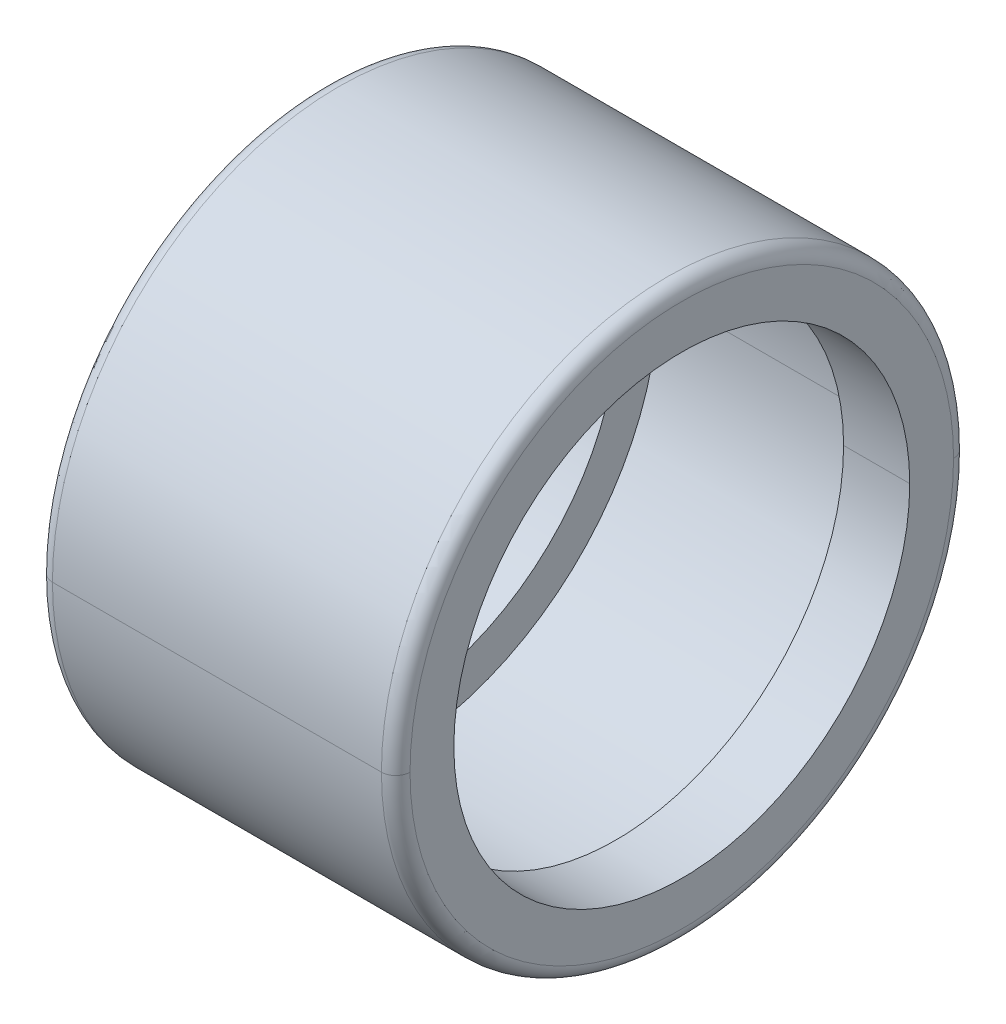
ISO-10303-21;
HEADER;
FILE_DESCRIPTION(('STEP AP214'),'2;1');
FILE_NAME('part.step','',(''),(''),'','','');
FILE_SCHEMA(('AUTOMOTIVE_DESIGN { 1 0 10303 214 1 1 1 1 }'));
ENDSEC;
DATA;
#1=APPLICATION_CONTEXT('core data for automotive mechanical design processes');
#2=APPLICATION_PROTOCOL_DEFINITION('international standard','automotive_design',2000,#1);
#3=PRODUCT_CONTEXT('',#1,'mechanical');
#4=PRODUCT('Part','Part','',(#3));
#5=PRODUCT_RELATED_PRODUCT_CATEGORY('part','',(#4));
#6=PRODUCT_DEFINITION_FORMATION('','',#4);
#7=PRODUCT_DEFINITION_CONTEXT('part definition',#1,'design');
#8=PRODUCT_DEFINITION('design','',#6,#7);
#9=PRODUCT_DEFINITION_SHAPE('','',#8);
#10=(LENGTH_UNIT() NAMED_UNIT(*) SI_UNIT(.MILLI.,.METRE.));
#11=(NAMED_UNIT(*) PLANE_ANGLE_UNIT() SI_UNIT($,.RADIAN.));
#12=(NAMED_UNIT(*) SI_UNIT($,.STERADIAN.) SOLID_ANGLE_UNIT());
#13=UNCERTAINTY_MEASURE_WITH_UNIT(LENGTH_MEASURE(1.E-05),#10,'distance_accuracy_value','');
#14=(GEOMETRIC_REPRESENTATION_CONTEXT(3) GLOBAL_UNCERTAINTY_ASSIGNED_CONTEXT((#13)) GLOBAL_UNIT_ASSIGNED_CONTEXT((#10,
#11,#12)) REPRESENTATION_CONTEXT('',''));
#15=CARTESIAN_POINT('',(0.,0.,0.));
#16=DIRECTION('',(0.,0.,1.));
#17=DIRECTION('',(1.,0.,0.));
#18=AXIS2_PLACEMENT_3D('',#15,#16,#17);
#19=CARTESIAN_POINT('',(0.400000000000029,0.,0.));
#20=DIRECTION('',(1.,0.,0.));
#21=DIRECTION('',(0.,1.,0.));
#22=AXIS2_PLACEMENT_3D('',#19,#20,#21);
#23=TOROIDAL_SURFACE('',#22,7.6,0.4);
#24=CARTESIAN_POINT('',(0.,0.,0.));
#25=DIRECTION('',(1.,0.,0.));
#26=DIRECTION('',(0.,0.,-1.));
#27=AXIS2_PLACEMENT_3D('',#24,#25,#26);
#28=CIRCLE('',#27,7.6);
#29=CARTESIAN_POINT('',(0.,0.,7.6));
#30=VERTEX_POINT('',#29);
#31=CARTESIAN_POINT('',(0.,0.,-7.6));
#32=VERTEX_POINT('',#31);
#33=EDGE_CURVE('E11',#30,#32,#28,.T.);
#34=ORIENTED_EDGE('',*,*,#33,.T.);
#35=CARTESIAN_POINT('',(0.,0.,-7.6));
#36=CARTESIAN_POINT('',(-1.38835481056677E-07,0.,-7.60654499130435));
#37=CARTESIAN_POINT('',(0.000160633149967865,0.,-7.61308997079517));
#38=CARTESIAN_POINT('',(0.000803001885952105,0.,-7.62616416866676));
#39=CARTESIAN_POINT('',(0.0012845986364874,0.,-7.63269338704754));
#40=CARTESIAN_POINT('',(0.00256762002581285,0.,-7.6457203252161));
#41=CARTESIAN_POINT('',(0.00336904466460301,0.,-7.65221804500389));
#42=CARTESIAN_POINT('',(0.00528974736362985,0.,-7.66516633456039));
#43=CARTESIAN_POINT('',(0.00640902542386653,0.,-7.67161690432911));
#44=CARTESIAN_POINT('',(0.00896275025360659,0.,-7.68445535328379));
#45=CARTESIAN_POINT('',(0.01039719702311,0.,-7.69084323246976));
#46=CARTESIAN_POINT('',(0.0135778004213121,0.,-7.70354091145285));
#47=CARTESIAN_POINT('',(0.0153239570500109,0.,-7.70985071124997));
#48=CARTESIAN_POINT('',(0.0191237743642793,0.,-7.7223770305536));
#49=CARTESIAN_POINT('',(0.0211774350498489,0.,-7.72859355006012));
#50=CARTESIAN_POINT('',(0.0255873128037914,0.,-7.74091833265365));
#51=CARTESIAN_POINT('',(0.0279435298721642,0.,-7.74702659574066));
#52=CARTESIAN_POINT('',(0.0329528441188634,0.,-7.75912015015141));
#53=CARTESIAN_POINT('',(0.0356059412971897,0.,-7.76510544147514));
#54=CARTESIAN_POINT('',(0.0412026242041124,0.,-7.77693863326908));
#55=CARTESIAN_POINT('',(0.0441462099327088,0.,-7.78278653373929));
#56=CARTESIAN_POINT('',(0.0503167785886638,0.,-7.79433085572151));
#57=CARTESIAN_POINT('',(0.0535437615160222,0.,-7.80002727723352));
#58=CARTESIAN_POINT('',(0.0602733504838164,0.,-7.81125491812105));
#59=CARTESIAN_POINT('',(0.0637759565242521,0.,-7.81678613749656));
#60=CARTESIAN_POINT('',(0.0710483536337682,0.,-7.82767004891912));
#61=CARTESIAN_POINT('',(0.0748181447028487,0.,-7.83302274096616));
#62=CARTESIAN_POINT('',(0.0826158301126913,0.,-7.84353670262779));
#63=CARTESIAN_POINT('',(0.0866437244534535,0.,-7.84869797224238));
#64=CARTESIAN_POINT('',(0.0949479128564129,0.,-7.85881665508853));
#65=CARTESIAN_POINT('',(0.0992242069186102,0.,-7.8637740683201));
#66=CARTESIAN_POINT('',(0.108014892797479,0.,-7.87347309555751));
#67=CARTESIAN_POINT('',(0.11252928461415,0.,-7.87821470956336));
#68=CARTESIAN_POINT('',(0.121785290436668,0.,-7.88747071538588));
#69=CARTESIAN_POINT('',(0.126526904442514,0.,-7.89198510720255));
#70=CARTESIAN_POINT('',(0.136225931679926,0.,-7.90077579308142));
#71=CARTESIAN_POINT('',(0.141183344911492,0.,-7.90505208714361));
#72=CARTESIAN_POINT('',(0.151302027757648,0.,-7.91335627554657));
#73=CARTESIAN_POINT('',(0.156463297372239,0.,-7.91738416988733));
#74=CARTESIAN_POINT('',(0.16697725903387,0.,-7.92518185529718));
#75=CARTESIAN_POINT('',(0.172329951080911,0.,-7.92895164636626));
#76=CARTESIAN_POINT('',(0.183213862503463,0.,-7.93622404347578));
#77=CARTESIAN_POINT('',(0.188745081878975,0.,-7.93972664951621));
#78=CARTESIAN_POINT('',(0.199972722766502,0.,-7.94645623848401));
#79=CARTESIAN_POINT('',(0.205669144278518,0.,-7.94968322141136));
#80=CARTESIAN_POINT('',(0.217213466260739,0.,-7.95585379006732));
#81=CARTESIAN_POINT('',(0.223061366730945,0.,-7.95879737579591));
#82=CARTESIAN_POINT('',(0.234894558524885,0.,-7.96439405870284));
#83=CARTESIAN_POINT('',(0.240879849848619,0.,-7.96704715588116));
#84=CARTESIAN_POINT('',(0.252973404259364,0.,-7.97205647012786));
#85=CARTESIAN_POINT('',(0.259081667346374,0.,-7.97441268719624));
#86=CARTESIAN_POINT('',(0.271406449939904,0.,-7.97882256495018));
#87=CARTESIAN_POINT('',(0.277622969446424,0.,-7.98087622563575));
#88=CARTESIAN_POINT('',(0.290149288750061,0.,-7.98467604295002));
#89=CARTESIAN_POINT('',(0.296459088547178,0.,-7.98642219957872));
#90=CARTESIAN_POINT('',(0.309156767530265,0.,-7.98960280297692));
#91=CARTESIAN_POINT('',(0.315544646716234,0.,-7.99103724974642));
#92=CARTESIAN_POINT('',(0.328383095670918,0.,-7.99359097457616));
#93=CARTESIAN_POINT('',(0.334833665439632,0.,-7.9947102526364));
#94=CARTESIAN_POINT('',(0.347781954996133,0.,-7.99663095533542));
#95=CARTESIAN_POINT('',(0.35427967478392,0.,-7.99743237997422));
#96=CARTESIAN_POINT('',(0.367306612952486,0.,-7.99871540136354));
#97=CARTESIAN_POINT('',(0.373835831333264,0.,-7.99919699811408));
#98=CARTESIAN_POINT('',(0.386910029204856,0.,-7.99983936685006));
#99=CARTESIAN_POINT('',(0.393455008695671,0.,-8.00000013883551));
#100=CARTESIAN_POINT('',(0.400000000000027,0.,-8.));
#101=B_SPLINE_CURVE_WITH_KNOTS('',3,(#35,#36,#37,#38,#39,#40,#41,#42,#43,#44,#45,#46,#47,#48,
#49,#50,#51,#52,#53,#54,#55,#56,#57,#58,#59,#60,#61,#62,#63,#64,#65,#66,#67,#68,#69,#70,#71,#72,
#73,#74,#75,#76,#77,#78,#79,#80,#81,#82,#83,#84,#85,#86,#87,#88,#89,#90,#91,#92,#93,#94,#95,#96,
#97,#98,#99,#100),.UNSPECIFIED.,.F.,.F.,(4,2,2,2,2,2,2,2,2,2,2,2,2,2,2,2,2,2,2,2,2,2,2,2,2,2,2,
2,2,2,2,2,4),(0.,0.0196329828183305,0.0392659656366597,0.0588989484549896,0.0785319312733197,
0.0981649140916497,0.117797896909979,0.137430879728309,0.157063862546639,0.176696845364969,
0.196329828183298,0.215962811001629,0.235595793819958,0.255228776638289,0.274861759456618,
0.294494742274948,0.314127725093278,0.333760707911607,0.353393690729937,0.373026673548267,
0.392659656366596,0.412292639184927,0.431925622003257,0.451558604821586,0.471191587639916,
0.490824570458246,0.510457553276576,0.530090536094905,0.549723518913235,0.569356501731565,
0.588989484549895,0.608622467368225,0.628255450186554),.UNSPECIFIED.);
#102=CARTESIAN_POINT('',(0.399999999999998,0.,-8.));
#103=VERTEX_POINT('',#102);
#104=EDGE_CURVE('E26',#32,#103,#101,.T.);
#105=ORIENTED_EDGE('',*,*,#104,.T.);
#106=CARTESIAN_POINT('',(0.399999999999998,0.,0.));
#107=DIRECTION('',(1.,0.,0.));
#108=DIRECTION('',(0.,0.,-1.));
#109=AXIS2_PLACEMENT_3D('',#106,#107,#108);
#110=CIRCLE('',#109,8.);
#111=CARTESIAN_POINT('',(0.400000000000029,0.,8.));
#112=VERTEX_POINT('',#111);
#113=EDGE_CURVE('E264',#112,#103,#110,.T.);
#114=ORIENTED_EDGE('',*,*,#113,.F.);
#115=CARTESIAN_POINT('',(0.,0.,7.6));
#116=CARTESIAN_POINT('',(-1.38835481043592E-07,0.,7.60654499130436));
#117=CARTESIAN_POINT('',(0.000160633149967881,0.,7.61308997079517));
#118=CARTESIAN_POINT('',(0.000803001885952117,0.,7.62616416866676));
#119=CARTESIAN_POINT('',(0.00128459863648743,0.,7.63269338704754));
#120=CARTESIAN_POINT('',(0.0025676200258129,0.,7.64572032521611));
#121=CARTESIAN_POINT('',(0.00336904466460304,0.,7.65221804500389));
#122=CARTESIAN_POINT('',(0.0052897473636299,0.,7.66516633456039));
#123=CARTESIAN_POINT('',(0.0064090254238666,0.,7.67161690432911));
#124=CARTESIAN_POINT('',(0.00896275025360669,0.,7.68445535328379));
#125=CARTESIAN_POINT('',(0.0103971970231101,0.,7.69084323246976));
#126=CARTESIAN_POINT('',(0.0135778004213122,0.,7.70354091145285));
#127=CARTESIAN_POINT('',(0.0153239570500109,0.,7.70985071124997));
#128=CARTESIAN_POINT('',(0.0191237743642794,0.,7.7223770305536));
#129=CARTESIAN_POINT('',(0.0211774350498492,0.,7.72859355006012));
#130=CARTESIAN_POINT('',(0.0255873128037916,0.,7.74091833265365));
#131=CARTESIAN_POINT('',(0.0279435298721643,0.,7.74702659574066));
#132=CARTESIAN_POINT('',(0.0329528441188634,0.,7.75912015015141));
#133=CARTESIAN_POINT('',(0.0356059412971898,0.,7.76510544147514));
#134=CARTESIAN_POINT('',(0.0412026242041126,0.,7.77693863326908));
#135=CARTESIAN_POINT('',(0.044146209932709,0.,7.78278653373929));
#136=CARTESIAN_POINT('',(0.0503167785886639,0.,7.79433085572151));
#137=CARTESIAN_POINT('',(0.0535437615160225,0.,7.80002727723352));
#138=CARTESIAN_POINT('',(0.0602733504838167,0.,7.81125491812105));
#139=CARTESIAN_POINT('',(0.0637759565242523,0.,7.81678613749656));
#140=CARTESIAN_POINT('',(0.0710483536337684,0.,7.82767004891912));
#141=CARTESIAN_POINT('',(0.0748181447028489,0.,7.83302274096616));
#142=CARTESIAN_POINT('',(0.0826158301126916,0.,7.84353670262779));
#143=CARTESIAN_POINT('',(0.0866437244534537,0.,7.84869797224238));
#144=CARTESIAN_POINT('',(0.0949479128564132,0.,7.85881665508853));
#145=CARTESIAN_POINT('',(0.0992242069186105,0.,7.8637740683201));
#146=CARTESIAN_POINT('',(0.108014892797479,0.,7.87347309555751));
#147=CARTESIAN_POINT('',(0.11252928461415,0.,7.87821470956336));
#148=CARTESIAN_POINT('',(0.121785290436668,0.,7.88747071538588));
#149=CARTESIAN_POINT('',(0.126526904442515,0.,7.89198510720255));
#150=CARTESIAN_POINT('',(0.136225931679927,0.,7.90077579308142));
#151=CARTESIAN_POINT('',(0.141183344911492,0.,7.90505208714361));
#152=CARTESIAN_POINT('',(0.151302027757648,0.,7.91335627554658));
#153=CARTESIAN_POINT('',(0.156463297372239,0.,7.91738416988733));
#154=CARTESIAN_POINT('',(0.166977259033871,0.,7.92518185529718));
#155=CARTESIAN_POINT('',(0.172329951080911,0.,7.92895164636626));
#156=CARTESIAN_POINT('',(0.183213862503463,0.,7.93622404347578));
#157=CARTESIAN_POINT('',(0.188745081878975,0.,7.93972664951621));
#158=CARTESIAN_POINT('',(0.199972722766503,0.,7.94645623848401));
#159=CARTESIAN_POINT('',(0.205669144278518,0.,7.94968322141136));
#160=CARTESIAN_POINT('',(0.217213466260739,0.,7.95585379006732));
#161=CARTESIAN_POINT('',(0.223061366730945,0.,7.95879737579591));
#162=CARTESIAN_POINT('',(0.234894558524885,0.,7.96439405870284));
#163=CARTESIAN_POINT('',(0.240879849848619,0.,7.96704715588116));
#164=CARTESIAN_POINT('',(0.252973404259364,0.,7.97205647012786));
#165=CARTESIAN_POINT('',(0.259081667346375,0.,7.97441268719624));
#166=CARTESIAN_POINT('',(0.271406449939905,0.,7.97882256495018));
#167=CARTESIAN_POINT('',(0.277622969446424,0.,7.98087622563575));
#168=CARTESIAN_POINT('',(0.290149288750061,0.,7.98467604295002));
#169=CARTESIAN_POINT('',(0.296459088547179,0.,7.98642219957872));
#170=CARTESIAN_POINT('',(0.309156767530265,0.,7.98960280297692));
#171=CARTESIAN_POINT('',(0.315544646716235,0.,7.99103724974642));
#172=CARTESIAN_POINT('',(0.328383095670918,0.,7.99359097457616));
#173=CARTESIAN_POINT('',(0.334833665439632,0.,7.9947102526364));
#174=CARTESIAN_POINT('',(0.347781954996134,0.,7.99663095533542));
#175=CARTESIAN_POINT('',(0.354279674783921,0.,7.99743237997422));
#176=CARTESIAN_POINT('',(0.367306612952486,0.,7.99871540136354));
#177=CARTESIAN_POINT('',(0.373835831333264,0.,7.99919699811408));
#178=CARTESIAN_POINT('',(0.386910029204857,0.,7.99983936685006));
#179=CARTESIAN_POINT('',(0.393455008695672,0.,8.00000013883551));
#180=CARTESIAN_POINT('',(0.400000000000028,0.,8.));
#181=B_SPLINE_CURVE_WITH_KNOTS('',3,(#115,#116,#117,#118,#119,#120,#121,#122,#123,#124,#125,
#126,#127,#128,#129,#130,#131,#132,#133,#134,#135,#136,#137,#138,#139,#140,#141,#142,#143,#144,
#145,#146,#147,#148,#149,#150,#151,#152,#153,#154,#155,#156,#157,#158,#159,#160,#161,#162,#163,
#164,#165,#166,#167,#168,#169,#170,#171,#172,#173,#174,#175,#176,#177,#178,#179,#180),
.UNSPECIFIED.,.F.,.F.,(4,2,2,2,2,2,2,2,2,2,2,2,2,2,2,2,2,2,2,2,2,2,2,2,2,2,2,2,2,2,2,2,4),(0.,
0.0196329828183296,0.0392659656366597,0.0588989484549896,0.0785319312733188,0.0981649140916488,
0.117797896909979,0.137430879728308,0.157063862546639,0.176696845364969,0.196329828183298,
0.215962811001628,0.235595793819957,0.255228776638288,0.274861759456618,0.294494742274947,
0.314127725093277,0.333760707911607,0.353393690729937,0.373026673548266,0.392659656366597,
0.412292639184926,0.431925622003256,0.451558604821586,0.471191587639916,0.490824570458245,
0.510457553276575,0.530090536094905,0.549723518913235,0.569356501731564,0.588989484549894,
0.608622467368224,0.628255450186554),.UNSPECIFIED.);
#182=EDGE_CURVE('E252',#30,#112,#181,.T.);
#183=ORIENTED_EDGE('',*,*,#182,.F.);
#184=EDGE_LOOP('',(#34,#105,#114,#183));
#185=FACE_BOUND('',#184,.T.);
#186=ADVANCED_FACE('F17',(#185),#23,.T.);
#187=CARTESIAN_POINT('',(0.400000000000029,0.,0.));
#188=DIRECTION('',(1.,0.,0.));
#189=DIRECTION('',(0.,-1.,0.));
#190=AXIS2_PLACEMENT_3D('',#187,#188,#189);
#191=TOROIDAL_SURFACE('',#190,7.6,0.4);
#192=CARTESIAN_POINT('',(0.399999999999998,0.,0.));
#193=DIRECTION('',(1.,0.,0.));
#194=DIRECTION('',(0.,0.,-1.));
#195=AXIS2_PLACEMENT_3D('',#192,#193,#194);
#196=CIRCLE('',#195,8.);
#197=EDGE_CURVE('E120',#103,#112,#196,.T.);
#198=ORIENTED_EDGE('',*,*,#197,.F.);
#199=ORIENTED_EDGE('',*,*,#104,.F.);
#200=CARTESIAN_POINT('',(0.,0.,0.));
#201=DIRECTION('',(1.,0.,0.));
#202=DIRECTION('',(0.,0.,-1.));
#203=AXIS2_PLACEMENT_3D('',#200,#201,#202);
#204=CIRCLE('',#203,7.6);
#205=EDGE_CURVE('E216',#32,#30,#204,.T.);
#206=ORIENTED_EDGE('',*,*,#205,.T.);
#207=ORIENTED_EDGE('',*,*,#182,.T.);
#208=EDGE_LOOP('',(#198,#199,#206,#207));
#209=FACE_BOUND('',#208,.T.);
#210=ADVANCED_FACE('F224',(#209),#191,.T.);
#211=CARTESIAN_POINT('',(0.,7.6,0.));
#212=DIRECTION('',(-1.,0.,0.));
#213=DIRECTION('',(0.,0.,1.));
#214=AXIS2_PLACEMENT_3D('',#211,#212,#213);
#215=PLANE('',#214);
#216=CARTESIAN_POINT('',(0.,0.,0.));
#217=DIRECTION('',(1.,0.,0.));
#218=DIRECTION('',(0.,0.,-1.));
#219=AXIS2_PLACEMENT_3D('',#216,#217,#218);
#220=CIRCLE('',#219,6.375);
#221=CARTESIAN_POINT('',(0.,0.,-6.375));
#222=VERTEX_POINT('',#221);
#223=CARTESIAN_POINT('',(0.,0.,6.375));
#224=VERTEX_POINT('',#223);
#225=EDGE_CURVE('E212',#222,#224,#220,.T.);
#226=ORIENTED_EDGE('',*,*,#225,.T.);
#227=CARTESIAN_POINT('',(0.,0.,0.));
#228=DIRECTION('',(1.,0.,0.));
#229=DIRECTION('',(0.,0.,-1.));
#230=AXIS2_PLACEMENT_3D('',#227,#228,#229);
#231=CIRCLE('',#230,6.375);
#232=EDGE_CURVE('E208',#224,#222,#231,.T.);
#233=ORIENTED_EDGE('',*,*,#232,.T.);
#234=EDGE_LOOP('',(#226,#233));
#235=FACE_BOUND('',#234,.T.);
#236=ORIENTED_EDGE('',*,*,#205,.F.);
#237=ORIENTED_EDGE('',*,*,#33,.F.);
#238=EDGE_LOOP('',(#236,#237));
#239=FACE_BOUND('',#238,.T.);
#240=ADVANCED_FACE('F233',(#235,#239),#215,.T.);
#241=CARTESIAN_POINT('',(50.,0.,0.));
#242=DIRECTION('',(-1.,0.,0.));
#243=DIRECTION('',(0.,1.,0.));
#244=AXIS2_PLACEMENT_3D('',#241,#242,#243);
#245=CYLINDRICAL_SURFACE('',#244,6.375);
#246=ORIENTED_EDGE('',*,*,#232,.F.);
#247=DIRECTION('',(-1.,0.,0.));
#248=VECTOR('',#247,1.);
#249=CARTESIAN_POINT('',(1.85,0.,6.375));
#250=LINE('',#249,#248);
#251=CARTESIAN_POINT('',(1.85,0.,6.375));
#252=VERTEX_POINT('',#251);
#253=EDGE_CURVE('E203',#252,#224,#250,.T.);
#254=ORIENTED_EDGE('',*,*,#253,.F.);
#255=CARTESIAN_POINT('',(1.85,0.,0.));
#256=DIRECTION('',(1.,0.,0.));
#257=DIRECTION('',(0.,0.,-1.));
#258=AXIS2_PLACEMENT_3D('',#255,#256,#257);
#259=CIRCLE('',#258,6.375);
#260=CARTESIAN_POINT('',(1.85,0.,-6.375));
#261=VERTEX_POINT('',#260);
#262=EDGE_CURVE('E199',#252,#261,#259,.T.);
#263=ORIENTED_EDGE('',*,*,#262,.T.);
#264=DIRECTION('',(-1.,0.,0.));
#265=VECTOR('',#264,1.);
#266=CARTESIAN_POINT('',(1.85,0.,-6.375));
#267=LINE('',#266,#265);
#268=EDGE_CURVE('E194',#261,#222,#267,.T.);
#269=ORIENTED_EDGE('',*,*,#268,.T.);
#270=EDGE_LOOP('',(#246,#254,#263,#269));
#271=FACE_BOUND('',#270,.T.);
#272=ADVANCED_FACE('F277',(#271),#245,.F.);
#273=CARTESIAN_POINT('',(50.,0.,0.));
#274=DIRECTION('',(-1.,0.,0.));
#275=DIRECTION('',(0.,-1.,0.));
#276=AXIS2_PLACEMENT_3D('',#273,#274,#275);
#277=CYLINDRICAL_SURFACE('',#276,6.375);
#278=CARTESIAN_POINT('',(1.85,0.,0.));
#279=DIRECTION('',(1.,0.,0.));
#280=DIRECTION('',(0.,0.,-1.));
#281=AXIS2_PLACEMENT_3D('',#278,#279,#280);
#282=CIRCLE('',#281,6.375);
#283=EDGE_CURVE('E189',#261,#252,#282,.T.);
#284=ORIENTED_EDGE('',*,*,#283,.T.);
#285=ORIENTED_EDGE('',*,*,#253,.T.);
#286=ORIENTED_EDGE('',*,*,#225,.F.);
#287=ORIENTED_EDGE('',*,*,#268,.F.);
#288=EDGE_LOOP('',(#284,#285,#286,#287));
#289=FACE_BOUND('',#288,.T.);
#290=ADVANCED_FACE('F283',(#289),#277,.F.);
#291=CARTESIAN_POINT('',(1.85,6.375,0.));
#292=DIRECTION('',(1.,0.,0.));
#293=DIRECTION('',(0.,0.,-1.));
#294=AXIS2_PLACEMENT_3D('',#291,#292,#293);
#295=PLANE('',#294);
#296=CARTESIAN_POINT('',(1.85,0.,0.));
#297=DIRECTION('',(1.,0.,0.));
#298=DIRECTION('',(0.,0.,-1.));
#299=AXIS2_PLACEMENT_3D('',#296,#297,#298);
#300=CIRCLE('',#299,7.5);
#301=CARTESIAN_POINT('',(1.85,0.,-7.5));
#302=VERTEX_POINT('',#301);
#303=CARTESIAN_POINT('',(1.85,0.,7.5));
#304=VERTEX_POINT('',#303);
#305=EDGE_CURVE('E185',#302,#304,#300,.T.);
#306=ORIENTED_EDGE('',*,*,#305,.T.);
#307=CARTESIAN_POINT('',(1.85,0.,0.));
#308=DIRECTION('',(1.,0.,0.));
#309=DIRECTION('',(0.,0.,-1.));
#310=AXIS2_PLACEMENT_3D('',#307,#308,#309);
#311=CIRCLE('',#310,7.5);
#312=EDGE_CURVE('E181',#304,#302,#311,.T.);
#313=ORIENTED_EDGE('',*,*,#312,.T.);
#314=EDGE_LOOP('',(#306,#313));
#315=FACE_BOUND('',#314,.T.);
#316=ORIENTED_EDGE('',*,*,#283,.F.);
#317=ORIENTED_EDGE('',*,*,#262,.F.);
#318=EDGE_LOOP('',(#316,#317));
#319=FACE_BOUND('',#318,.T.);
#320=ADVANCED_FACE('F316',(#315,#319),#295,.T.);
#321=CARTESIAN_POINT('',(50.,0.,0.));
#322=DIRECTION('',(-1.,0.,0.));
#323=DIRECTION('',(0.,1.,0.));
#324=AXIS2_PLACEMENT_3D('',#321,#322,#323);
#325=CYLINDRICAL_SURFACE('',#324,7.5);
#326=ORIENTED_EDGE('',*,*,#312,.F.);
#327=DIRECTION('',(-1.,0.,0.));
#328=VECTOR('',#327,1.);
#329=CARTESIAN_POINT('',(8.15,0.,7.5));
#330=LINE('',#329,#328);
#331=CARTESIAN_POINT('',(8.15,0.,7.5));
#332=VERTEX_POINT('',#331);
#333=EDGE_CURVE('E176',#332,#304,#330,.T.);
#334=ORIENTED_EDGE('',*,*,#333,.F.);
#335=CARTESIAN_POINT('',(8.15,0.,0.));
#336=DIRECTION('',(1.,0.,0.));
#337=DIRECTION('',(0.,0.,-1.));
#338=AXIS2_PLACEMENT_3D('',#335,#336,#337);
#339=CIRCLE('',#338,7.5);
#340=CARTESIAN_POINT('',(8.15,0.,-7.5));
#341=VERTEX_POINT('',#340);
#342=EDGE_CURVE('E172',#332,#341,#339,.T.);
#343=ORIENTED_EDGE('',*,*,#342,.T.);
#344=DIRECTION('',(-1.,0.,0.));
#345=VECTOR('',#344,1.);
#346=CARTESIAN_POINT('',(8.15,0.,-7.5));
#347=LINE('',#346,#345);
#348=EDGE_CURVE('E167',#341,#302,#347,.T.);
#349=ORIENTED_EDGE('',*,*,#348,.T.);
#350=EDGE_LOOP('',(#326,#334,#343,#349));
#351=FACE_BOUND('',#350,.T.);
#352=ADVANCED_FACE('F326',(#351),#325,.F.);
#353=CARTESIAN_POINT('',(50.,0.,0.));
#354=DIRECTION('',(-1.,0.,0.));
#355=DIRECTION('',(0.,-1.,0.));
#356=AXIS2_PLACEMENT_3D('',#353,#354,#355);
#357=CYLINDRICAL_SURFACE('',#356,7.5);
#358=CARTESIAN_POINT('',(8.15,0.,0.));
#359=DIRECTION('',(1.,0.,0.));
#360=DIRECTION('',(0.,0.,-1.));
#361=AXIS2_PLACEMENT_3D('',#358,#359,#360);
#362=CIRCLE('',#361,7.5);
#363=EDGE_CURVE('E162',#341,#332,#362,.T.);
#364=ORIENTED_EDGE('',*,*,#363,.T.);
#365=ORIENTED_EDGE('',*,*,#333,.T.);
#366=ORIENTED_EDGE('',*,*,#305,.F.);
#367=ORIENTED_EDGE('',*,*,#348,.F.);
#368=EDGE_LOOP('',(#364,#365,#366,#367));
#369=FACE_BOUND('',#368,.T.);
#370=ADVANCED_FACE('F336',(#369),#357,.F.);
#371=CARTESIAN_POINT('',(8.15,7.5,0.));
#372=DIRECTION('',(-1.,0.,0.));
#373=DIRECTION('',(0.,0.,1.));
#374=AXIS2_PLACEMENT_3D('',#371,#372,#373);
#375=PLANE('',#374);
#376=CARTESIAN_POINT('',(8.15,0.,0.));
#377=DIRECTION('',(1.,0.,0.));
#378=DIRECTION('',(0.,0.,-1.));
#379=AXIS2_PLACEMENT_3D('',#376,#377,#378);
#380=CIRCLE('',#379,6.375);
#381=CARTESIAN_POINT('',(8.15,0.,-6.375));
#382=VERTEX_POINT('',#381);
#383=CARTESIAN_POINT('',(8.15,0.,6.375));
#384=VERTEX_POINT('',#383);
#385=EDGE_CURVE('E158',#382,#384,#380,.T.);
#386=ORIENTED_EDGE('',*,*,#385,.T.);
#387=CARTESIAN_POINT('',(8.15,0.,0.));
#388=DIRECTION('',(1.,0.,0.));
#389=DIRECTION('',(0.,0.,-1.));
#390=AXIS2_PLACEMENT_3D('',#387,#388,#389);
#391=CIRCLE('',#390,6.375);
#392=EDGE_CURVE('E154',#384,#382,#391,.T.);
#393=ORIENTED_EDGE('',*,*,#392,.T.);
#394=EDGE_LOOP('',(#386,#393));
#395=FACE_BOUND('',#394,.T.);
#396=ORIENTED_EDGE('',*,*,#363,.F.);
#397=ORIENTED_EDGE('',*,*,#342,.F.);
#398=EDGE_LOOP('',(#396,#397));
#399=FACE_BOUND('',#398,.T.);
#400=ADVANCED_FACE('F346',(#395,#399),#375,.T.);
#401=CARTESIAN_POINT('',(50.,0.,0.));
#402=DIRECTION('',(-1.,0.,0.));
#403=DIRECTION('',(0.,1.,0.));
#404=AXIS2_PLACEMENT_3D('',#401,#402,#403);
#405=CYLINDRICAL_SURFACE('',#404,6.375);
#406=ORIENTED_EDGE('',*,*,#392,.F.);
#407=DIRECTION('',(-1.,0.,0.));
#408=VECTOR('',#407,1.);
#409=CARTESIAN_POINT('',(10.,0.,6.375));
#410=LINE('',#409,#408);
#411=CARTESIAN_POINT('',(10.,0.,6.375));
#412=VERTEX_POINT('',#411);
#413=EDGE_CURVE('E149',#412,#384,#410,.T.);
#414=ORIENTED_EDGE('',*,*,#413,.F.);
#415=CARTESIAN_POINT('',(10.,0.,0.));
#416=DIRECTION('',(1.,0.,0.));
#417=DIRECTION('',(0.,0.,-1.));
#418=AXIS2_PLACEMENT_3D('',#415,#416,#417);
#419=CIRCLE('',#418,6.375);
#420=CARTESIAN_POINT('',(10.,0.,-6.375));
#421=VERTEX_POINT('',#420);
#422=EDGE_CURVE('E145',#412,#421,#419,.T.);
#423=ORIENTED_EDGE('',*,*,#422,.T.);
#424=DIRECTION('',(-1.,0.,0.));
#425=VECTOR('',#424,1.);
#426=CARTESIAN_POINT('',(10.,0.,-6.375));
#427=LINE('',#426,#425);
#428=EDGE_CURVE('E140',#421,#382,#427,.T.);
#429=ORIENTED_EDGE('',*,*,#428,.T.);
#430=EDGE_LOOP('',(#406,#414,#423,#429));
#431=FACE_BOUND('',#430,.T.);
#432=ADVANCED_FACE('F356',(#431),#405,.F.);
#433=CARTESIAN_POINT('',(50.,0.,0.));
#434=DIRECTION('',(-1.,0.,0.));
#435=DIRECTION('',(0.,-1.,0.));
#436=AXIS2_PLACEMENT_3D('',#433,#434,#435);
#437=CYLINDRICAL_SURFACE('',#436,6.375);
#438=CARTESIAN_POINT('',(10.,0.,0.));
#439=DIRECTION('',(1.,0.,0.));
#440=DIRECTION('',(0.,0.,-1.));
#441=AXIS2_PLACEMENT_3D('',#438,#439,#440);
#442=CIRCLE('',#441,6.375);
#443=EDGE_CURVE('E135',#421,#412,#442,.T.);
#444=ORIENTED_EDGE('',*,*,#443,.T.);
#445=ORIENTED_EDGE('',*,*,#413,.T.);
#446=ORIENTED_EDGE('',*,*,#385,.F.);
#447=ORIENTED_EDGE('',*,*,#428,.F.);
#448=EDGE_LOOP('',(#444,#445,#446,#447));
#449=FACE_BOUND('',#448,.T.);
#450=ADVANCED_FACE('F366',(#449),#437,.F.);
#451=CARTESIAN_POINT('',(10.,6.375,0.));
#452=DIRECTION('',(1.,0.,0.));
#453=DIRECTION('',(0.,0.,-1.));
#454=AXIS2_PLACEMENT_3D('',#451,#452,#453);
#455=PLANE('',#454);
#456=CARTESIAN_POINT('',(10.,0.,0.));
#457=DIRECTION('',(1.,0.,0.));
#458=DIRECTION('',(0.,0.,-1.));
#459=AXIS2_PLACEMENT_3D('',#456,#457,#458);
#460=CIRCLE('',#459,7.6);
#461=CARTESIAN_POINT('',(10.,0.,-7.6));
#462=VERTEX_POINT('',#461);
#463=CARTESIAN_POINT('',(9.99999999999994,0.,7.6));
#464=VERTEX_POINT('',#463);
#465=EDGE_CURVE('E126',#462,#464,#460,.T.);
#466=ORIENTED_EDGE('',*,*,#465,.T.);
#467=CARTESIAN_POINT('',(10.,0.,0.));
#468=DIRECTION('',(1.,0.,0.));
#469=DIRECTION('',(0.,0.,-1.));
#470=AXIS2_PLACEMENT_3D('',#467,#468,#469);
#471=CIRCLE('',#470,7.6);
#472=EDGE_CURVE('E99',#464,#462,#471,.T.);
#473=ORIENTED_EDGE('',*,*,#472,.T.);
#474=EDGE_LOOP('',(#466,#473));
#475=FACE_BOUND('',#474,.T.);
#476=ORIENTED_EDGE('',*,*,#443,.F.);
#477=ORIENTED_EDGE('',*,*,#422,.F.);
#478=EDGE_LOOP('',(#476,#477));
#479=FACE_BOUND('',#478,.T.);
#480=ADVANCED_FACE('F376',(#475,#479),#455,.T.);
#481=CARTESIAN_POINT('',(9.59999999999994,0.,0.));
#482=DIRECTION('',(1.,0.,0.));
#483=DIRECTION('',(0.,1.,0.));
#484=AXIS2_PLACEMENT_3D('',#481,#482,#483);
#485=TOROIDAL_SURFACE('',#484,7.6,0.4);
#486=CARTESIAN_POINT('',(9.6,0.,0.));
#487=DIRECTION('',(1.,0.,0.));
#488=DIRECTION('',(0.,0.,-1.));
#489=AXIS2_PLACEMENT_3D('',#486,#487,#488);
#490=CIRCLE('',#489,8.);
#491=CARTESIAN_POINT('',(9.59999999999994,0.,8.));
#492=VERTEX_POINT('',#491);
#493=CARTESIAN_POINT('',(9.6,0.,-8.));
#494=VERTEX_POINT('',#493);
#495=EDGE_CURVE('E97',#492,#494,#490,.T.);
#496=ORIENTED_EDGE('',*,*,#495,.T.);
#497=CARTESIAN_POINT('',(9.59999999999994,0.,-8.));
#498=CARTESIAN_POINT('',(9.60654499130429,0.,-8.00000013883551));
#499=CARTESIAN_POINT('',(9.61308997079511,0.,-7.99983936685006));
#500=CARTESIAN_POINT('',(9.6261641686667,0.,-7.99919699811408));
#501=CARTESIAN_POINT('',(9.63269338704748,0.,-7.99871540136354));
#502=CARTESIAN_POINT('',(9.64572032521605,0.,-7.99743237997422));
#503=CARTESIAN_POINT('',(9.65221804500383,0.,-7.99663095533543));
#504=CARTESIAN_POINT('',(9.66516633456033,0.,-7.9947102526364));
#505=CARTESIAN_POINT('',(9.67161690432905,0.,-7.99359097457616));
#506=CARTESIAN_POINT('',(9.68445535328373,0.,-7.99103724974642));
#507=CARTESIAN_POINT('',(9.6908432324697,0.,-7.98960280297692));
#508=CARTESIAN_POINT('',(9.70354091145279,0.,-7.98642219957872));
#509=CARTESIAN_POINT('',(9.7098507112499,0.,-7.98467604295002));
#510=CARTESIAN_POINT('',(9.72237703055354,0.,-7.98087622563575));
#511=CARTESIAN_POINT('',(9.72859355006006,0.,-7.97882256495018));
#512=CARTESIAN_POINT('',(9.74091833265359,0.,-7.97441268719624));
#513=CARTESIAN_POINT('',(9.7470265957406,0.,-7.97205647012786));
#514=CARTESIAN_POINT('',(9.75912015015135,0.,-7.96704715588116));
#515=CARTESIAN_POINT('',(9.76510544147508,0.,-7.96439405870284));
#516=CARTESIAN_POINT('',(9.77693863326902,0.,-7.95879737579592));
#517=CARTESIAN_POINT('',(9.78278653373923,0.,-7.95585379006732));
#518=CARTESIAN_POINT('',(9.79433085572145,0.,-7.94968322141136));
#519=CARTESIAN_POINT('',(9.80002727723346,0.,-7.94645623848401));
#520=CARTESIAN_POINT('',(9.81125491812099,0.,-7.93972664951621));
#521=CARTESIAN_POINT('',(9.8167861374965,0.,-7.93622404347578));
#522=CARTESIAN_POINT('',(9.82767004891905,0.,-7.92895164636626));
#523=CARTESIAN_POINT('',(9.8330227409661,0.,-7.92518185529718));
#524=CARTESIAN_POINT('',(9.84353670262773,0.,-7.91738416988734));
#525=CARTESIAN_POINT('',(9.84869797224232,0.,-7.91335627554658));
#526=CARTESIAN_POINT('',(9.85881665508848,0.,-7.90505208714361));
#527=CARTESIAN_POINT('',(9.86377406832004,0.,-7.90077579308142));
#528=CARTESIAN_POINT('',(9.87347309555745,0.,-7.89198510720255));
#529=CARTESIAN_POINT('',(9.8782147095633,0.,-7.88747071538588));
#530=CARTESIAN_POINT('',(9.88747071538582,0.,-7.87821470956336));
#531=CARTESIAN_POINT('',(9.89198510720249,0.,-7.87347309555751));
#532=CARTESIAN_POINT('',(9.90077579308136,0.,-7.8637740683201));
#533=CARTESIAN_POINT('',(9.90505208714355,0.,-7.85881665508854));
#534=CARTESIAN_POINT('',(9.91335627554651,0.,-7.84869797224238));
#535=CARTESIAN_POINT('',(9.91738416988727,0.,-7.84353670262779));
#536=CARTESIAN_POINT('',(9.92518185529712,0.,-7.83302274096616));
#537=CARTESIAN_POINT('',(9.9289516463662,0.,-7.82767004891912));
#538=CARTESIAN_POINT('',(9.93622404347571,0.,-7.81678613749657));
#539=CARTESIAN_POINT('',(9.93972664951615,0.,-7.81125491812105));
#540=CARTESIAN_POINT('',(9.94645623848394,0.,-7.80002727723353));
#541=CARTESIAN_POINT('',(9.9496832214113,0.,-7.79433085572151));
#542=CARTESIAN_POINT('',(9.95585379006726,0.,-7.78278653373929));
#543=CARTESIAN_POINT('',(9.95879737579586,0.,-7.77693863326908));
#544=CARTESIAN_POINT('',(9.96439405870278,0.,-7.76510544147514));
#545=CARTESIAN_POINT('',(9.9670471558811,0.,-7.75912015015141));
#546=CARTESIAN_POINT('',(9.9720564701278,0.,-7.74702659574066));
#547=CARTESIAN_POINT('',(9.97441268719617,0.,-7.74091833265365));
#548=CARTESIAN_POINT('',(9.97882256495012,0.,-7.72859355006012));
#549=CARTESIAN_POINT('',(9.98087622563569,0.,-7.7223770305536));
#550=CARTESIAN_POINT('',(9.98467604294996,0.,-7.70985071124997));
#551=CARTESIAN_POINT('',(9.98642219957866,0.,-7.70354091145285));
#552=CARTESIAN_POINT('',(9.98960280297686,0.,-7.69084323246976));
#553=CARTESIAN_POINT('',(9.99103724974636,0.,-7.68445535328379));
#554=CARTESIAN_POINT('',(9.9935909745761,0.,-7.67161690432911));
#555=CARTESIAN_POINT('',(9.99471025263634,0.,-7.6651663345604));
#556=CARTESIAN_POINT('',(9.99663095533536,0.,-7.6522180450039));
#557=CARTESIAN_POINT('',(9.99743237997416,0.,-7.64572032521611));
#558=CARTESIAN_POINT('',(9.99871540136348,0.,-7.63269338704754));
#559=CARTESIAN_POINT('',(9.99919699811402,0.,-7.62616416866676));
#560=CARTESIAN_POINT('',(9.99983936685,0.,-7.61308997079517));
#561=CARTESIAN_POINT('',(10.0000001388354,0.,-7.60654499130436));
#562=CARTESIAN_POINT('',(9.99999999999994,0.,-7.6));
#563=B_SPLINE_CURVE_WITH_KNOTS('',3,(#497,#498,#499,#500,#501,#502,#503,#504,#505,#506,#507,
#508,#509,#510,#511,#512,#513,#514,#515,#516,#517,#518,#519,#520,#521,#522,#523,#524,#525,#526,
#527,#528,#529,#530,#531,#532,#533,#534,#535,#536,#537,#538,#539,#540,#541,#542,#543,#544,#545,
#546,#547,#548,#549,#550,#551,#552,#553,#554,#555,#556,#557,#558,#559,#560,#561,#562),
.UNSPECIFIED.,.F.,.F.,(4,2,2,2,2,2,2,2,2,2,2,2,2,2,2,2,2,2,2,2,2,2,2,2,2,2,2,2,2,2,2,2,4),(0.,
0.0196329828183297,0.0392659656366588,0.0588989484549886,0.0785319312733196,0.0981649140916498,
0.117797896909978,0.137430879728309,0.157063862546638,0.176696845364968,0.196329828183298,
0.215962811001629,0.235595793819957,0.255228776638288,0.274861759456618,0.294494742274947,
0.314127725093278,0.333760707911606,0.353393690729935,0.373026673548267,0.392659656366596,
0.412292639184925,0.431925622003256,0.451558604821586,0.471191587639915,0.490824570458245,
0.510457553276575,0.530090536094905,0.549723518913235,0.569356501731564,0.588989484549894,
0.608622467368224,0.628255450186553),.UNSPECIFIED.);
#564=EDGE_CURVE('E103',#494,#462,#563,.T.);
#565=ORIENTED_EDGE('',*,*,#564,.T.);
#566=ORIENTED_EDGE('',*,*,#472,.F.);
#567=CARTESIAN_POINT('',(9.59999999999994,0.,8.));
#568=CARTESIAN_POINT('',(9.60654499130429,0.,8.00000013883551));
#569=CARTESIAN_POINT('',(9.61308997079511,0.,7.99983936685006));
#570=CARTESIAN_POINT('',(9.6261641686667,0.,7.99919699811408));
#571=CARTESIAN_POINT('',(9.63269338704748,0.,7.99871540136354));
#572=CARTESIAN_POINT('',(9.64572032521605,0.,7.99743237997422));
#573=CARTESIAN_POINT('',(9.65221804500383,0.,7.99663095533543));
#574=CARTESIAN_POINT('',(9.66516633456034,0.,7.9947102526364));
#575=CARTESIAN_POINT('',(9.67161690432905,0.,7.99359097457616));
#576=CARTESIAN_POINT('',(9.68445535328373,0.,7.99103724974642));
#577=CARTESIAN_POINT('',(9.6908432324697,0.,7.98960280297692));
#578=CARTESIAN_POINT('',(9.70354091145279,0.,7.98642219957872));
#579=CARTESIAN_POINT('',(9.7098507112499,0.,7.98467604295002));
#580=CARTESIAN_POINT('',(9.72237703055354,0.,7.98087622563575));
#581=CARTESIAN_POINT('',(9.72859355006006,0.,7.97882256495018));
#582=CARTESIAN_POINT('',(9.74091833265359,0.,7.97441268719624));
#583=CARTESIAN_POINT('',(9.7470265957406,0.,7.97205647012786));
#584=CARTESIAN_POINT('',(9.75912015015135,0.,7.96704715588116));
#585=CARTESIAN_POINT('',(9.76510544147508,0.,7.96439405870284));
#586=CARTESIAN_POINT('',(9.77693863326902,0.,7.95879737579592));
#587=CARTESIAN_POINT('',(9.78278653373923,0.,7.95585379006732));
#588=CARTESIAN_POINT('',(9.79433085572145,0.,7.94968322141136));
#589=CARTESIAN_POINT('',(9.80002727723346,0.,7.94645623848401));
#590=CARTESIAN_POINT('',(9.81125491812099,0.,7.93972664951621));
#591=CARTESIAN_POINT('',(9.8167861374965,0.,7.93622404347578));
#592=CARTESIAN_POINT('',(9.82767004891905,0.,7.92895164636626));
#593=CARTESIAN_POINT('',(9.8330227409661,0.,7.92518185529718));
#594=CARTESIAN_POINT('',(9.84353670262773,0.,7.91738416988734));
#595=CARTESIAN_POINT('',(9.84869797224232,0.,7.91335627554658));
#596=CARTESIAN_POINT('',(9.85881665508848,0.,7.90505208714361));
#597=CARTESIAN_POINT('',(9.86377406832004,0.,7.90077579308142));
#598=CARTESIAN_POINT('',(9.87347309555745,0.,7.89198510720255));
#599=CARTESIAN_POINT('',(9.8782147095633,0.,7.88747071538588));
#600=CARTESIAN_POINT('',(9.88747071538582,0.,7.87821470956336));
#601=CARTESIAN_POINT('',(9.89198510720249,0.,7.87347309555751));
#602=CARTESIAN_POINT('',(9.90077579308136,0.,7.8637740683201));
#603=CARTESIAN_POINT('',(9.90505208714355,0.,7.85881665508854));
#604=CARTESIAN_POINT('',(9.91335627554651,0.,7.84869797224238));
#605=CARTESIAN_POINT('',(9.91738416988728,0.,7.84353670262779));
#606=CARTESIAN_POINT('',(9.92518185529712,0.,7.83302274096616));
#607=CARTESIAN_POINT('',(9.9289516463662,0.,7.82767004891912));
#608=CARTESIAN_POINT('',(9.93622404347571,0.,7.81678613749657));
#609=CARTESIAN_POINT('',(9.93972664951615,0.,7.81125491812105));
#610=CARTESIAN_POINT('',(9.94645623848395,0.,7.80002727723352));
#611=CARTESIAN_POINT('',(9.9496832214113,0.,7.79433085572151));
#612=CARTESIAN_POINT('',(9.95585379006726,0.,7.78278653373929));
#613=CARTESIAN_POINT('',(9.95879737579586,0.,7.77693863326908));
#614=CARTESIAN_POINT('',(9.96439405870278,0.,7.76510544147514));
#615=CARTESIAN_POINT('',(9.9670471558811,0.,7.75912015015141));
#616=CARTESIAN_POINT('',(9.9720564701278,0.,7.74702659574066));
#617=CARTESIAN_POINT('',(9.97441268719617,0.,7.74091833265365));
#618=CARTESIAN_POINT('',(9.97882256495012,0.,7.72859355006012));
#619=CARTESIAN_POINT('',(9.98087622563569,0.,7.7223770305536));
#620=CARTESIAN_POINT('',(9.98467604294996,0.,7.70985071124997));
#621=CARTESIAN_POINT('',(9.98642219957866,0.,7.70354091145285));
#622=CARTESIAN_POINT('',(9.98960280297686,0.,7.69084323246976));
#623=CARTESIAN_POINT('',(9.99103724974636,0.,7.68445535328379));
#624=CARTESIAN_POINT('',(9.9935909745761,0.,7.67161690432911));
#625=CARTESIAN_POINT('',(9.99471025263634,0.,7.6651663345604));
#626=CARTESIAN_POINT('',(9.99663095533536,0.,7.65221804500389));
#627=CARTESIAN_POINT('',(9.99743237997416,0.,7.64572032521611));
#628=CARTESIAN_POINT('',(9.99871540136348,0.,7.63269338704754));
#629=CARTESIAN_POINT('',(9.99919699811402,0.,7.62616416866676));
#630=CARTESIAN_POINT('',(9.99983936685,0.,7.61308997079517));
#631=CARTESIAN_POINT('',(10.0000001388354,0.,7.60654499130436));
#632=CARTESIAN_POINT('',(9.99999999999994,0.,7.6));
#633=B_SPLINE_CURVE_WITH_KNOTS('',3,(#567,#568,#569,#570,#571,#572,#573,#574,#575,#576,#577,
#578,#579,#580,#581,#582,#583,#584,#585,#586,#587,#588,#589,#590,#591,#592,#593,#594,#595,#596,
#597,#598,#599,#600,#601,#602,#603,#604,#605,#606,#607,#608,#609,#610,#611,#612,#613,#614,#615,
#616,#617,#618,#619,#620,#621,#622,#623,#624,#625,#626,#627,#628,#629,#630,#631,#632),
.UNSPECIFIED.,.F.,.F.,(4,2,2,2,2,2,2,2,2,2,2,2,2,2,2,2,2,2,2,2,2,2,2,2,2,2,2,2,2,2,2,2,4),(0.,
0.0196329828183297,0.0392659656366605,0.0588989484549903,0.0785319312733196,0.0981649140916499,
0.11779789690998,0.137430879728309,0.157063862546638,0.176696845364968,0.196329828183298,
0.215962811001629,0.235595793819958,0.255228776638288,0.274861759456618,0.294494742274947,
0.314127725093278,0.333760707911607,0.353393690729938,0.373026673548267,0.392659656366596,
0.412292639184927,0.431925622003256,0.451558604821586,0.471191587639916,0.490824570458245,
0.510457553276576,0.530090536094905,0.549723518913235,0.569356501731565,0.588989484549895,
0.608622467368224,0.628255450186555),.UNSPECIFIED.);
#634=EDGE_CURVE('E91',#492,#464,#633,.T.);
#635=ORIENTED_EDGE('',*,*,#634,.F.);
#636=EDGE_LOOP('',(#496,#565,#566,#635));
#637=FACE_BOUND('',#636,.T.);
#638=ADVANCED_FACE('F94',(#637),#485,.T.);
#639=CARTESIAN_POINT('',(9.59999999999994,0.,0.));
#640=DIRECTION('',(1.,0.,0.));
#641=DIRECTION('',(0.,-1.,0.));
#642=AXIS2_PLACEMENT_3D('',#639,#640,#641);
#643=TOROIDAL_SURFACE('',#642,7.6,0.4);
#644=ORIENTED_EDGE('',*,*,#465,.F.);
#645=ORIENTED_EDGE('',*,*,#564,.F.);
#646=CARTESIAN_POINT('',(9.6,0.,0.));
#647=DIRECTION('',(1.,0.,0.));
#648=DIRECTION('',(0.,0.,-1.));
#649=AXIS2_PLACEMENT_3D('',#646,#647,#648);
#650=CIRCLE('',#649,8.);
#651=EDGE_CURVE('E104',#494,#492,#650,.T.);
#652=ORIENTED_EDGE('',*,*,#651,.T.);
#653=ORIENTED_EDGE('',*,*,#634,.T.);
#654=EDGE_LOOP('',(#644,#645,#652,#653));
#655=FACE_BOUND('',#654,.T.);
#656=ADVANCED_FACE('F109',(#655),#643,.T.);
#657=CARTESIAN_POINT('',(50.,0.,0.));
#658=DIRECTION('',(-1.,0.,0.));
#659=DIRECTION('',(0.,-1.,0.));
#660=AXIS2_PLACEMENT_3D('',#657,#658,#659);
#661=CYLINDRICAL_SURFACE('',#660,8.);
#662=ORIENTED_EDGE('',*,*,#651,.F.);
#663=DIRECTION('',(-1.,0.,0.));
#664=VECTOR('',#663,1.);
#665=CARTESIAN_POINT('',(9.6,0.,-8.));
#666=LINE('',#665,#664);
#667=EDGE_CURVE('E114',#494,#103,#666,.T.);
#668=ORIENTED_EDGE('',*,*,#667,.T.);
#669=ORIENTED_EDGE('',*,*,#197,.T.);
#670=DIRECTION('',(-1.,0.,0.));
#671=VECTOR('',#670,1.);
#672=CARTESIAN_POINT('',(9.6,0.,8.));
#673=LINE('',#672,#671);
#674=EDGE_CURVE('E118',#492,#112,#673,.T.);
#675=ORIENTED_EDGE('',*,*,#674,.F.);
#676=EDGE_LOOP('',(#662,#668,#669,#675));
#677=FACE_BOUND('',#676,.T.);
#678=ADVANCED_FACE('F119',(#677),#661,.T.);
#679=CARTESIAN_POINT('',(50.,0.,0.));
#680=DIRECTION('',(-1.,0.,0.));
#681=DIRECTION('',(0.,1.,0.));
#682=AXIS2_PLACEMENT_3D('',#679,#680,#681);
#683=CYLINDRICAL_SURFACE('',#682,8.);
#684=ORIENTED_EDGE('',*,*,#113,.T.);
#685=ORIENTED_EDGE('',*,*,#667,.F.);
#686=ORIENTED_EDGE('',*,*,#495,.F.);
#687=ORIENTED_EDGE('',*,*,#674,.T.);
#688=EDGE_LOOP('',(#684,#685,#686,#687));
#689=FACE_BOUND('',#688,.T.);
#690=ADVANCED_FACE('F124',(#689),#683,.T.);
#691=CLOSED_SHELL('',(#186,#210,#240,#272,#290,#320,#352,#370,#400,#432,#450,#480,#638,#656,
#678,#690));
#692=MANIFOLD_SOLID_BREP('B1',#691);
#693=ADVANCED_BREP_SHAPE_REPRESENTATION('',(#18,#692),#14);
#694=SHAPE_DEFINITION_REPRESENTATION(#9,#693);
ENDSEC;
END-ISO-10303-21;
